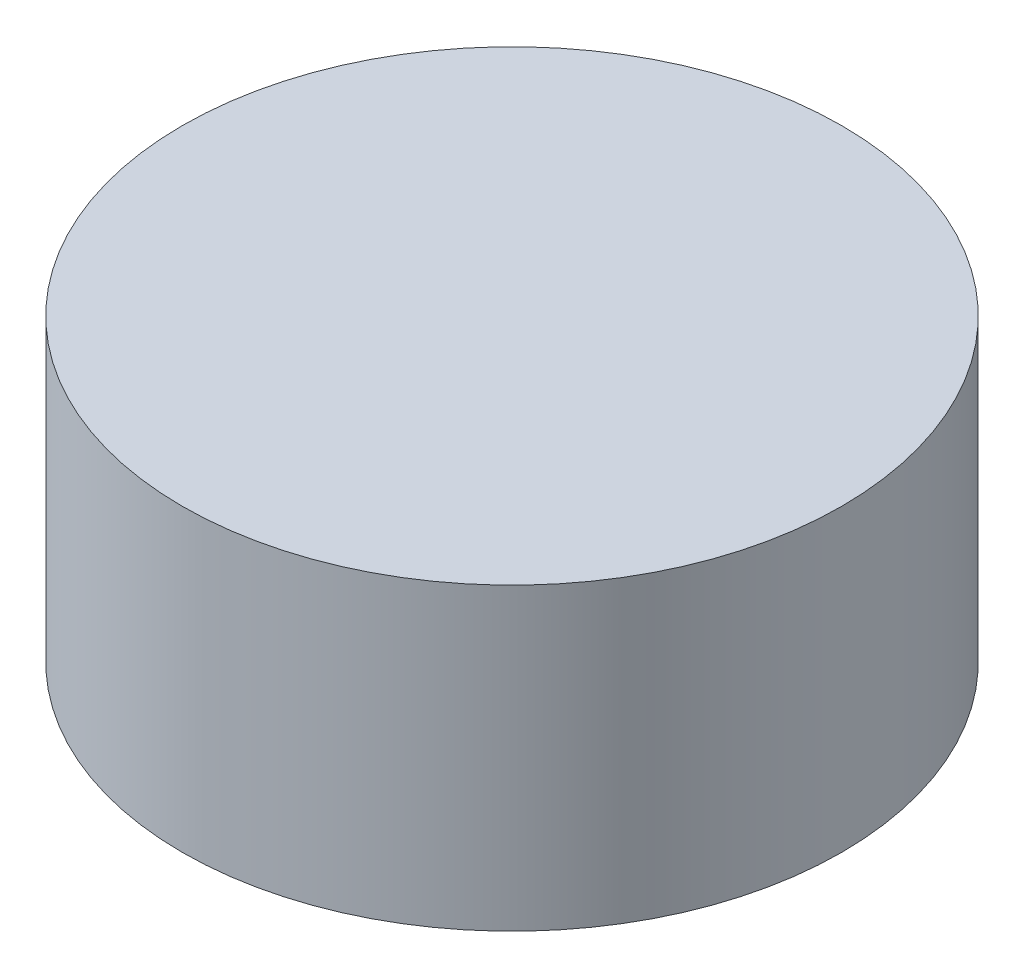
ISO-10303-21;
HEADER;
FILE_DESCRIPTION(('STEP AP214'),'2;1');
FILE_NAME('part.step','',(''),(''),'','','');
FILE_SCHEMA(('AUTOMOTIVE_DESIGN { 1 0 10303 214 1 1 1 1 }'));
ENDSEC;
DATA;
#1=APPLICATION_CONTEXT('core data for automotive mechanical design processes');
#2=APPLICATION_PROTOCOL_DEFINITION('international standard','automotive_design',2000,#1);
#3=PRODUCT_CONTEXT('',#1,'mechanical');
#4=PRODUCT('Part','Part','',(#3));
#5=PRODUCT_RELATED_PRODUCT_CATEGORY('part','',(#4));
#6=PRODUCT_DEFINITION_FORMATION('','',#4);
#7=PRODUCT_DEFINITION_CONTEXT('part definition',#1,'design');
#8=PRODUCT_DEFINITION('design','',#6,#7);
#9=PRODUCT_DEFINITION_SHAPE('','',#8);
#10=(LENGTH_UNIT() NAMED_UNIT(*) SI_UNIT(.MILLI.,.METRE.));
#11=(NAMED_UNIT(*) PLANE_ANGLE_UNIT() SI_UNIT($,.RADIAN.));
#12=(NAMED_UNIT(*) SI_UNIT($,.STERADIAN.) SOLID_ANGLE_UNIT());
#13=UNCERTAINTY_MEASURE_WITH_UNIT(LENGTH_MEASURE(1.E-05),#10,'distance_accuracy_value','');
#14=(GEOMETRIC_REPRESENTATION_CONTEXT(3) GLOBAL_UNCERTAINTY_ASSIGNED_CONTEXT((#13)) GLOBAL_UNIT_ASSIGNED_CONTEXT((#10,
#11,#12)) REPRESENTATION_CONTEXT('',''));
#15=CARTESIAN_POINT('',(0.,0.,0.));
#16=DIRECTION('',(0.,0.,1.));
#17=DIRECTION('',(1.,0.,0.));
#18=AXIS2_PLACEMENT_3D('',#15,#16,#17);
#19=CARTESIAN_POINT('',(0.,5.,0.));
#20=DIRECTION('',(0.,-1.,0.));
#21=DIRECTION('',(0.,0.,-1.));
#22=AXIS2_PLACEMENT_3D('',#19,#20,#21);
#23=CYLINDRICAL_SURFACE('',#22,5.5);
#24=CARTESIAN_POINT('',(0.,5.,0.));
#25=DIRECTION('',(0.,1.,0.));
#26=DIRECTION('',(0.,0.,1.));
#27=AXIS2_PLACEMENT_3D('',#24,#25,#26);
#28=CIRCLE('',#27,5.5);
#29=CARTESIAN_POINT('',(0.,5.,5.5));
#30=VERTEX_POINT('',#29);
#31=EDGE_CURVE('E10',#30,#30,#28,.T.);
#32=ORIENTED_EDGE('',*,*,#31,.F.);
#33=EDGE_LOOP('',(#32));
#34=FACE_BOUND('',#33,.T.);
#35=CARTESIAN_POINT('',(0.,0.,0.));
#36=DIRECTION('',(0.,1.,0.));
#37=DIRECTION('',(0.,0.,1.));
#38=AXIS2_PLACEMENT_3D('',#35,#36,#37);
#39=CIRCLE('',#38,5.5);
#40=CARTESIAN_POINT('',(0.,0.,5.5));
#41=VERTEX_POINT('',#40);
#42=EDGE_CURVE('E40',#41,#41,#39,.T.);
#43=ORIENTED_EDGE('',*,*,#42,.T.);
#44=EDGE_LOOP('',(#43));
#45=FACE_BOUND('',#44,.T.);
#46=ADVANCED_FACE('F37',(#34,#45),#23,.T.);
#47=CARTESIAN_POINT('',(0.,5.,0.));
#48=DIRECTION('',(0.,1.,0.));
#49=DIRECTION('',(0.,0.,1.));
#50=AXIS2_PLACEMENT_3D('',#47,#48,#49);
#51=PLANE('',#50);
#52=ORIENTED_EDGE('',*,*,#31,.T.);
#53=EDGE_LOOP('',(#52));
#54=FACE_BOUND('',#53,.T.);
#55=ADVANCED_FACE('F54',(#54),#51,.T.);
#56=CARTESIAN_POINT('',(0.,0.,0.));
#57=DIRECTION('',(0.,1.,0.));
#58=DIRECTION('',(0.,0.,1.));
#59=AXIS2_PLACEMENT_3D('',#56,#57,#58);
#60=PLANE('',#59);
#61=ORIENTED_EDGE('',*,*,#42,.F.);
#62=EDGE_LOOP('',(#61));
#63=FACE_BOUND('',#62,.T.);
#64=ADVANCED_FACE('F52',(#63),#60,.F.);
#65=CLOSED_SHELL('',(#46,#55,#64));
#66=MANIFOLD_SOLID_BREP('B2',#65);
#67=ADVANCED_BREP_SHAPE_REPRESENTATION('',(#18,#66),#14);
#68=SHAPE_DEFINITION_REPRESENTATION(#9,#67);
ENDSEC;
END-ISO-10303-21;
